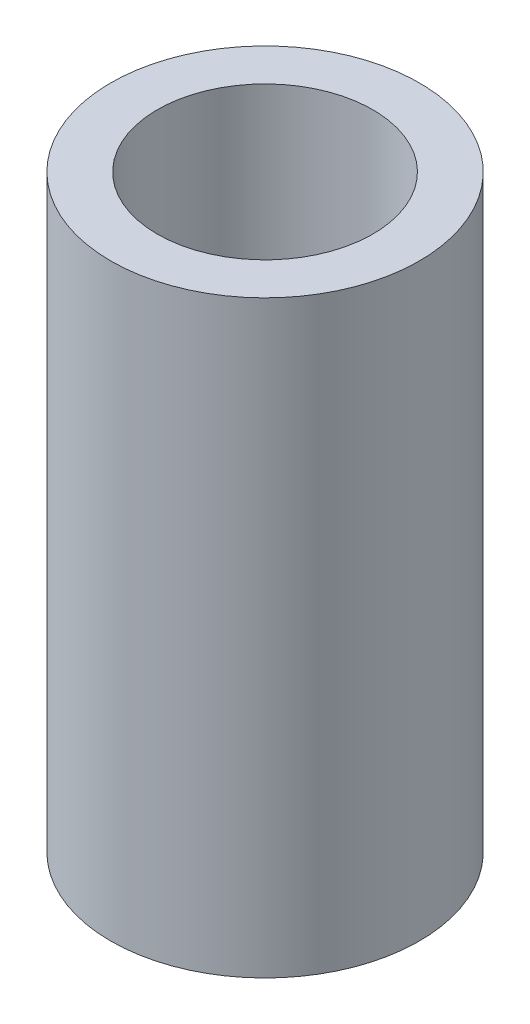
ISO-10303-21;
HEADER;
FILE_DESCRIPTION(('STEP AP214'),'2;1');
FILE_NAME('part.step','',(''),(''),'','','');
FILE_SCHEMA(('AUTOMOTIVE_DESIGN { 1 0 10303 214 1 1 1 1 }'));
ENDSEC;
DATA;
#1=APPLICATION_CONTEXT('core data for automotive mechanical design processes');
#2=APPLICATION_PROTOCOL_DEFINITION('international standard','automotive_design',2000,#1);
#3=PRODUCT_CONTEXT('',#1,'mechanical');
#4=PRODUCT('Part','Part','',(#3));
#5=PRODUCT_RELATED_PRODUCT_CATEGORY('part','',(#4));
#6=PRODUCT_DEFINITION_FORMATION('','',#4);
#7=PRODUCT_DEFINITION_CONTEXT('part definition',#1,'design');
#8=PRODUCT_DEFINITION('design','',#6,#7);
#9=PRODUCT_DEFINITION_SHAPE('','',#8);
#10=(LENGTH_UNIT() NAMED_UNIT(*) SI_UNIT(.MILLI.,.METRE.));
#11=(NAMED_UNIT(*) PLANE_ANGLE_UNIT() SI_UNIT($,.RADIAN.));
#12=(NAMED_UNIT(*) SI_UNIT($,.STERADIAN.) SOLID_ANGLE_UNIT());
#13=UNCERTAINTY_MEASURE_WITH_UNIT(LENGTH_MEASURE(1.E-05),#10,'distance_accuracy_value','');
#14=(GEOMETRIC_REPRESENTATION_CONTEXT(3) GLOBAL_UNCERTAINTY_ASSIGNED_CONTEXT((#13)) GLOBAL_UNIT_ASSIGNED_CONTEXT((#10,
#11,#12)) REPRESENTATION_CONTEXT('',''));
#15=CARTESIAN_POINT('',(0.,0.,0.));
#16=DIRECTION('',(0.,0.,1.));
#17=DIRECTION('',(1.,0.,0.));
#18=AXIS2_PLACEMENT_3D('',#15,#16,#17);
#19=CARTESIAN_POINT('',(0.,85.9013379508561,0.));
#20=DIRECTION('',(0.,-1.,0.));
#21=DIRECTION('',(0.,0.,-1.));
#22=AXIS2_PLACEMENT_3D('',#19,#20,#21);
#23=CYLINDRICAL_SURFACE('',#22,22.5);
#24=CARTESIAN_POINT('',(0.,85.9013379508561,0.));
#25=DIRECTION('',(0.,1.,0.));
#26=DIRECTION('',(0.,0.,1.));
#27=AXIS2_PLACEMENT_3D('',#24,#25,#26);
#28=CIRCLE('',#27,22.5);
#29=CARTESIAN_POINT('',(0.,85.9013379508561,22.5));
#30=VERTEX_POINT('',#29);
#31=EDGE_CURVE('E10',#30,#30,#28,.T.);
#32=ORIENTED_EDGE('',*,*,#31,.F.);
#33=EDGE_LOOP('',(#32));
#34=FACE_BOUND('',#33,.T.);
#35=CARTESIAN_POINT('',(0.,0.,0.));
#36=DIRECTION('',(0.,1.,0.));
#37=DIRECTION('',(0.,0.,1.));
#38=AXIS2_PLACEMENT_3D('',#35,#36,#37);
#39=CIRCLE('',#38,22.5);
#40=CARTESIAN_POINT('',(0.,0.,22.5));
#41=VERTEX_POINT('',#40);
#42=EDGE_CURVE('E37',#41,#41,#39,.T.);
#43=ORIENTED_EDGE('',*,*,#42,.T.);
#44=EDGE_LOOP('',(#43));
#45=FACE_BOUND('',#44,.T.);
#46=ADVANCED_FACE('F40',(#34,#45),#23,.T.);
#47=CARTESIAN_POINT('',(0.,85.9013379508561,0.));
#48=DIRECTION('',(0.,1.,0.));
#49=DIRECTION('',(0.,0.,1.));
#50=AXIS2_PLACEMENT_3D('',#47,#48,#49);
#51=PLANE('',#50);
#52=CARTESIAN_POINT('',(0.,85.9013379508561,0.));
#53=DIRECTION('',(0.,1.,0.));
#54=DIRECTION('',(0.,0.,1.));
#55=AXIS2_PLACEMENT_3D('',#52,#53,#54);
#56=CIRCLE('',#55,15.7172739046409);
#57=CARTESIAN_POINT('',(0.,85.9013379508561,15.7172739046409));
#58=VERTEX_POINT('',#57);
#59=EDGE_CURVE('E50',#58,#58,#56,.T.);
#60=ORIENTED_EDGE('',*,*,#59,.F.);
#61=EDGE_LOOP('',(#60));
#62=FACE_BOUND('',#61,.T.);
#63=ORIENTED_EDGE('',*,*,#31,.T.);
#64=EDGE_LOOP('',(#63));
#65=FACE_BOUND('',#64,.T.);
#66=ADVANCED_FACE('F59',(#62,#65),#51,.T.);
#67=CARTESIAN_POINT('',(0.,0.,0.));
#68=DIRECTION('',(0.,1.,0.));
#69=DIRECTION('',(0.,0.,1.));
#70=AXIS2_PLACEMENT_3D('',#67,#68,#69);
#71=PLANE('',#70);
#72=CARTESIAN_POINT('',(0.,0.,0.));
#73=DIRECTION('',(0.,1.,0.));
#74=DIRECTION('',(0.,0.,1.));
#75=AXIS2_PLACEMENT_3D('',#72,#73,#74);
#76=CIRCLE('',#75,15.7172739046409);
#77=CARTESIAN_POINT('',(0.,0.,15.7172739046409));
#78=VERTEX_POINT('',#77);
#79=EDGE_CURVE('E47',#78,#78,#76,.T.);
#80=ORIENTED_EDGE('',*,*,#79,.T.);
#81=EDGE_LOOP('',(#80));
#82=FACE_BOUND('',#81,.T.);
#83=ORIENTED_EDGE('',*,*,#42,.F.);
#84=EDGE_LOOP('',(#83));
#85=FACE_BOUND('',#84,.T.);
#86=ADVANCED_FACE('F58',(#82,#85),#71,.F.);
#87=CARTESIAN_POINT('',(0.,85.9013379508561,0.));
#88=DIRECTION('',(0.,-1.,0.));
#89=DIRECTION('',(0.,0.,-1.));
#90=AXIS2_PLACEMENT_3D('',#87,#88,#89);
#91=CYLINDRICAL_SURFACE('',#90,15.7172739046409);
#92=ORIENTED_EDGE('',*,*,#59,.T.);
#93=EDGE_LOOP('',(#92));
#94=FACE_BOUND('',#93,.T.);
#95=ORIENTED_EDGE('',*,*,#79,.F.);
#96=EDGE_LOOP('',(#95));
#97=FACE_BOUND('',#96,.T.);
#98=ADVANCED_FACE('F54',(#94,#97),#91,.F.);
#99=CLOSED_SHELL('',(#46,#66,#86,#98));
#100=MANIFOLD_SOLID_BREP('B2',#99);
#101=ADVANCED_BREP_SHAPE_REPRESENTATION('',(#18,#100),#14);
#102=SHAPE_DEFINITION_REPRESENTATION(#9,#101);
ENDSEC;
END-ISO-10303-21;
